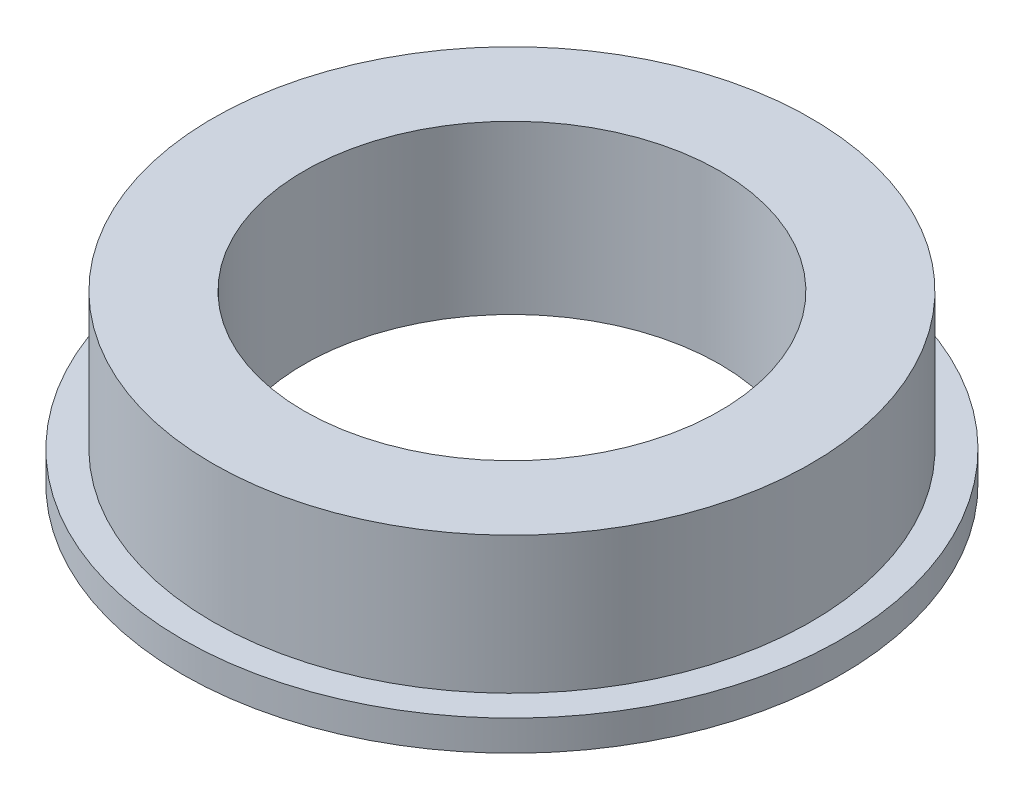
ISO-10303-21;
HEADER;
FILE_DESCRIPTION(('STEP AP214'),'2;1');
FILE_NAME('part.step','',(''),(''),'','','');
FILE_SCHEMA(('AUTOMOTIVE_DESIGN { 1 0 10303 214 1 1 1 1 }'));
ENDSEC;
DATA;
#1=APPLICATION_CONTEXT('core data for automotive mechanical design processes');
#2=APPLICATION_PROTOCOL_DEFINITION('international standard','automotive_design',2000,#1);
#3=PRODUCT_CONTEXT('',#1,'mechanical');
#4=PRODUCT('Part','Part','',(#3));
#5=PRODUCT_RELATED_PRODUCT_CATEGORY('part','',(#4));
#6=PRODUCT_DEFINITION_FORMATION('','',#4);
#7=PRODUCT_DEFINITION_CONTEXT('part definition',#1,'design');
#8=PRODUCT_DEFINITION('design','',#6,#7);
#9=PRODUCT_DEFINITION_SHAPE('','',#8);
#10=(LENGTH_UNIT() NAMED_UNIT(*) SI_UNIT(.MILLI.,.METRE.));
#11=(NAMED_UNIT(*) PLANE_ANGLE_UNIT() SI_UNIT($,.RADIAN.));
#12=(NAMED_UNIT(*) SI_UNIT($,.STERADIAN.) SOLID_ANGLE_UNIT());
#13=UNCERTAINTY_MEASURE_WITH_UNIT(LENGTH_MEASURE(1.E-05),#10,'distance_accuracy_value','');
#14=(GEOMETRIC_REPRESENTATION_CONTEXT(3) GLOBAL_UNCERTAINTY_ASSIGNED_CONTEXT((#13)) GLOBAL_UNIT_ASSIGNED_CONTEXT((#10,
#11,#12)) REPRESENTATION_CONTEXT('',''));
#15=CARTESIAN_POINT('',(0.,0.,0.));
#16=DIRECTION('',(0.,0.,1.));
#17=DIRECTION('',(1.,0.,0.));
#18=AXIS2_PLACEMENT_3D('',#15,#16,#17);
#19=CARTESIAN_POINT('',(6.5,0.1,0.));
#20=DIRECTION('',(0.,1.,0.));
#21=DIRECTION('',(0.,0.,1.));
#22=AXIS2_PLACEMENT_3D('',#19,#20,#21);
#23=PLANE('',#22);
#24=CARTESIAN_POINT('',(0.,0.0999999999999998,0.));
#25=DIRECTION('',(0.,1.,0.));
#26=DIRECTION('',(0.,0.,1.));
#27=AXIS2_PLACEMENT_3D('',#24,#25,#26);
#28=CIRCLE('',#27,6.5);
#29=CARTESIAN_POINT('',(0.,0.0999999999999998,6.5));
#30=VERTEX_POINT('',#29);
#31=EDGE_CURVE('E50',#30,#30,#28,.T.);
#32=ORIENTED_EDGE('',*,*,#31,.F.);
#33=EDGE_LOOP('',(#32));
#34=FACE_BOUND('',#33,.T.);
#35=CARTESIAN_POINT('',(0.,0.0999999999999998,0.));
#36=DIRECTION('',(0.,1.,0.));
#37=DIRECTION('',(0.,0.,1.));
#38=AXIS2_PLACEMENT_3D('',#35,#36,#37);
#39=CIRCLE('',#38,4.1);
#40=CARTESIAN_POINT('',(0.,0.0999999999999998,4.1));
#41=VERTEX_POINT('',#40);
#42=EDGE_CURVE('E10',#41,#41,#39,.T.);
#43=ORIENTED_EDGE('',*,*,#42,.T.);
#44=EDGE_LOOP('',(#43));
#45=FACE_BOUND('',#44,.T.);
#46=ADVANCED_FACE('F28',(#34,#45),#23,.F.);
#47=CARTESIAN_POINT('',(0.,2.63468075946736,0.));
#48=DIRECTION('',(0.,1.,0.));
#49=DIRECTION('',(0.,0.,1.));
#50=AXIS2_PLACEMENT_3D('',#47,#48,#49);
#51=CYLINDRICAL_SURFACE('',#50,4.1);
#52=ORIENTED_EDGE('',*,*,#42,.F.);
#53=EDGE_LOOP('',(#52));
#54=FACE_BOUND('',#53,.T.);
#55=CARTESIAN_POINT('',(0.,3.4,0.));
#56=DIRECTION('',(0.,1.,0.));
#57=DIRECTION('',(0.,0.,1.));
#58=AXIS2_PLACEMENT_3D('',#55,#56,#57);
#59=CIRCLE('',#58,4.1);
#60=CARTESIAN_POINT('',(0.,3.4,4.1));
#61=VERTEX_POINT('',#60);
#62=EDGE_CURVE('E34',#61,#61,#59,.T.);
#63=ORIENTED_EDGE('',*,*,#62,.T.);
#64=EDGE_LOOP('',(#63));
#65=FACE_BOUND('',#64,.T.);
#66=ADVANCED_FACE('F57',(#54,#65),#51,.F.);
#67=CARTESIAN_POINT('',(4.1,3.4,0.));
#68=DIRECTION('',(0.,-1.,0.));
#69=DIRECTION('',(0.,0.,-1.));
#70=AXIS2_PLACEMENT_3D('',#67,#68,#69);
#71=PLANE('',#70);
#72=ORIENTED_EDGE('',*,*,#62,.F.);
#73=EDGE_LOOP('',(#72));
#74=FACE_BOUND('',#73,.T.);
#75=CARTESIAN_POINT('',(0.,3.4,0.));
#76=DIRECTION('',(0.,1.,0.));
#77=DIRECTION('',(0.,0.,1.));
#78=AXIS2_PLACEMENT_3D('',#75,#76,#77);
#79=CIRCLE('',#78,5.9);
#80=CARTESIAN_POINT('',(0.,3.4,5.9));
#81=VERTEX_POINT('',#80);
#82=EDGE_CURVE('E38',#81,#81,#79,.T.);
#83=ORIENTED_EDGE('',*,*,#82,.T.);
#84=EDGE_LOOP('',(#83));
#85=FACE_BOUND('',#84,.T.);
#86=ADVANCED_FACE('F61',(#74,#85),#71,.F.);
#87=CARTESIAN_POINT('',(0.,2.63468075946736,0.));
#88=DIRECTION('',(0.,1.,0.));
#89=DIRECTION('',(0.,0.,1.));
#90=AXIS2_PLACEMENT_3D('',#87,#88,#89);
#91=CYLINDRICAL_SURFACE('',#90,5.9);
#92=ORIENTED_EDGE('',*,*,#82,.F.);
#93=EDGE_LOOP('',(#92));
#94=FACE_BOUND('',#93,.T.);
#95=CARTESIAN_POINT('',(0.,0.7,0.));
#96=DIRECTION('',(0.,1.,0.));
#97=DIRECTION('',(0.,0.,1.));
#98=AXIS2_PLACEMENT_3D('',#95,#96,#97);
#99=CIRCLE('',#98,5.9);
#100=CARTESIAN_POINT('',(0.,0.7,5.9));
#101=VERTEX_POINT('',#100);
#102=EDGE_CURVE('E42',#101,#101,#99,.T.);
#103=ORIENTED_EDGE('',*,*,#102,.T.);
#104=EDGE_LOOP('',(#103));
#105=FACE_BOUND('',#104,.T.);
#106=ADVANCED_FACE('F66',(#94,#105),#91,.T.);
#107=CARTESIAN_POINT('',(5.9,0.7,0.));
#108=DIRECTION('',(0.,-1.,0.));
#109=DIRECTION('',(0.,0.,-1.));
#110=AXIS2_PLACEMENT_3D('',#107,#108,#109);
#111=PLANE('',#110);
#112=ORIENTED_EDGE('',*,*,#102,.F.);
#113=EDGE_LOOP('',(#112));
#114=FACE_BOUND('',#113,.T.);
#115=CARTESIAN_POINT('',(0.,0.7,0.));
#116=DIRECTION('',(0.,1.,0.));
#117=DIRECTION('',(0.,0.,1.));
#118=AXIS2_PLACEMENT_3D('',#115,#116,#117);
#119=CIRCLE('',#118,6.5);
#120=CARTESIAN_POINT('',(0.,0.7,6.5));
#121=VERTEX_POINT('',#120);
#122=EDGE_CURVE('E47',#121,#121,#119,.T.);
#123=ORIENTED_EDGE('',*,*,#122,.T.);
#124=EDGE_LOOP('',(#123));
#125=FACE_BOUND('',#124,.T.);
#126=ADVANCED_FACE('F72',(#114,#125),#111,.F.);
#127=CARTESIAN_POINT('',(0.,2.63468075946736,0.));
#128=DIRECTION('',(0.,1.,0.));
#129=DIRECTION('',(0.,0.,1.));
#130=AXIS2_PLACEMENT_3D('',#127,#128,#129);
#131=CYLINDRICAL_SURFACE('',#130,6.5);
#132=ORIENTED_EDGE('',*,*,#122,.F.);
#133=EDGE_LOOP('',(#132));
#134=FACE_BOUND('',#133,.T.);
#135=ORIENTED_EDGE('',*,*,#31,.T.);
#136=EDGE_LOOP('',(#135));
#137=FACE_BOUND('',#136,.T.);
#138=ADVANCED_FACE('F54',(#134,#137),#131,.T.);
#139=CLOSED_SHELL('',(#46,#66,#86,#106,#126,#138));
#140=MANIFOLD_SOLID_BREP('B2',#139);
#141=ADVANCED_BREP_SHAPE_REPRESENTATION('',(#18,#140),#14);
#142=SHAPE_DEFINITION_REPRESENTATION(#9,#141);
ENDSEC;
END-ISO-10303-21;
